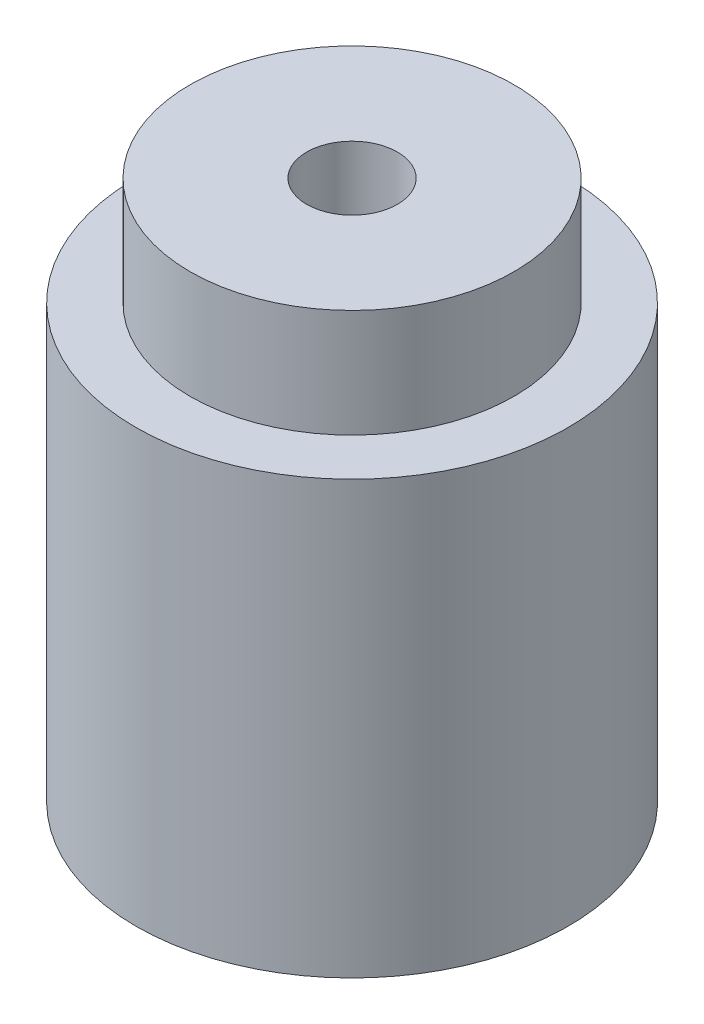
ISO-10303-21;
HEADER;
FILE_DESCRIPTION(('STEP AP214'),'2;1');
FILE_NAME('part.step','',(''),(''),'','','');
FILE_SCHEMA(('AUTOMOTIVE_DESIGN { 1 0 10303 214 1 1 1 1 }'));
ENDSEC;
DATA;
#1=APPLICATION_CONTEXT('core data for automotive mechanical design processes');
#2=APPLICATION_PROTOCOL_DEFINITION('international standard','automotive_design',2000,#1);
#3=PRODUCT_CONTEXT('',#1,'mechanical');
#4=PRODUCT('Part','Part','',(#3));
#5=PRODUCT_RELATED_PRODUCT_CATEGORY('part','',(#4));
#6=PRODUCT_DEFINITION_FORMATION('','',#4);
#7=PRODUCT_DEFINITION_CONTEXT('part definition',#1,'design');
#8=PRODUCT_DEFINITION('design','',#6,#7);
#9=PRODUCT_DEFINITION_SHAPE('','',#8);
#10=(LENGTH_UNIT() NAMED_UNIT(*) SI_UNIT(.MILLI.,.METRE.));
#11=(NAMED_UNIT(*) PLANE_ANGLE_UNIT() SI_UNIT($,.RADIAN.));
#12=(NAMED_UNIT(*) SI_UNIT($,.STERADIAN.) SOLID_ANGLE_UNIT());
#13=UNCERTAINTY_MEASURE_WITH_UNIT(LENGTH_MEASURE(1.E-05),#10,'distance_accuracy_value','');
#14=(GEOMETRIC_REPRESENTATION_CONTEXT(3) GLOBAL_UNCERTAINTY_ASSIGNED_CONTEXT((#13)) GLOBAL_UNIT_ASSIGNED_CONTEXT((#10,
#11,#12)) REPRESENTATION_CONTEXT('',''));
#15=CARTESIAN_POINT('',(0.,0.,0.));
#16=DIRECTION('',(0.,0.,1.));
#17=DIRECTION('',(1.,0.,0.));
#18=AXIS2_PLACEMENT_3D('',#15,#16,#17);
#19=CARTESIAN_POINT('',(0.,25.,0.));
#20=DIRECTION('',(0.,1.,0.));
#21=DIRECTION('',(0.,0.,1.));
#22=AXIS2_PLACEMENT_3D('',#19,#20,#21);
#23=PLANE('',#22);
#24=CARTESIAN_POINT('',(0.,25.,0.));
#25=DIRECTION('',(0.,1.,0.));
#26=DIRECTION('',(0.,0.,1.));
#27=AXIS2_PLACEMENT_3D('',#24,#25,#26);
#28=CIRCLE('',#27,2.1);
#29=CARTESIAN_POINT('',(0.,25.,2.1));
#30=VERTEX_POINT('',#29);
#31=EDGE_CURVE('E59',#30,#30,#28,.T.);
#32=ORIENTED_EDGE('',*,*,#31,.F.);
#33=EDGE_LOOP('',(#32));
#34=FACE_BOUND('',#33,.T.);
#35=CARTESIAN_POINT('',(0.,25.,0.));
#36=DIRECTION('',(0.,1.,0.));
#37=DIRECTION('',(0.,0.,1.));
#38=AXIS2_PLACEMENT_3D('',#35,#36,#37);
#39=CIRCLE('',#38,7.5);
#40=CARTESIAN_POINT('',(0.,25.,7.5));
#41=VERTEX_POINT('',#40);
#42=EDGE_CURVE('E67',#41,#41,#39,.T.);
#43=ORIENTED_EDGE('',*,*,#42,.T.);
#44=EDGE_LOOP('',(#43));
#45=FACE_BOUND('',#44,.T.);
#46=ADVANCED_FACE('F41',(#34,#45),#23,.T.);
#47=CARTESIAN_POINT('',(0.,11.2618072999579,0.));
#48=DIRECTION('',(0.,1.,0.));
#49=DIRECTION('',(0.,0.,1.));
#50=AXIS2_PLACEMENT_3D('',#47,#48,#49);
#51=CONICAL_SURFACE('',#50,2.1,1.02974425867665);
#52=CARTESIAN_POINT('',(0.,10.,0.));
#53=VERTEX_POINT('',#52);
#54=VERTEX_LOOP('',#53);
#55=FACE_BOUND('',#54,.T.);
#56=CARTESIAN_POINT('',(0.,11.2618072999579,0.));
#57=DIRECTION('',(0.,1.,0.));
#58=DIRECTION('',(0.,0.,1.));
#59=AXIS2_PLACEMENT_3D('',#56,#57,#58);
#60=CIRCLE('',#59,2.1);
#61=CARTESIAN_POINT('',(0.,11.2618072999579,2.1));
#62=VERTEX_POINT('',#61);
#63=EDGE_CURVE('E48',#62,#62,#60,.T.);
#64=ORIENTED_EDGE('',*,*,#63,.T.);
#65=EDGE_LOOP('',(#64));
#66=FACE_BOUND('',#65,.T.);
#67=ADVANCED_FACE('F51',(#55,#66),#51,.F.);
#68=CARTESIAN_POINT('',(0.,25.,0.));
#69=DIRECTION('',(0.,1.,0.));
#70=DIRECTION('',(0.,0.,1.));
#71=AXIS2_PLACEMENT_3D('',#68,#69,#70);
#72=CYLINDRICAL_SURFACE('',#71,2.1);
#73=ORIENTED_EDGE('',*,*,#63,.F.);
#74=EDGE_LOOP('',(#73));
#75=FACE_BOUND('',#74,.T.);
#76=ORIENTED_EDGE('',*,*,#31,.T.);
#77=EDGE_LOOP('',(#76));
#78=FACE_BOUND('',#77,.T.);
#79=ADVANCED_FACE('F54',(#75,#78),#72,.F.);
#80=CARTESIAN_POINT('',(0.,20.,0.));
#81=DIRECTION('',(0.,1.,0.));
#82=DIRECTION('',(0.,0.,1.));
#83=AXIS2_PLACEMENT_3D('',#80,#81,#82);
#84=PLANE('',#83);
#85=CARTESIAN_POINT('',(0.,20.,0.));
#86=DIRECTION('',(0.,1.,0.));
#87=DIRECTION('',(0.,0.,1.));
#88=AXIS2_PLACEMENT_3D('',#85,#86,#87);
#89=CIRCLE('',#88,7.5);
#90=CARTESIAN_POINT('',(0.,20.,7.5));
#91=VERTEX_POINT('',#90);
#92=EDGE_CURVE('E66',#91,#91,#89,.T.);
#93=ORIENTED_EDGE('',*,*,#92,.F.);
#94=EDGE_LOOP('',(#93));
#95=FACE_BOUND('',#94,.T.);
#96=CARTESIAN_POINT('',(0.,20.,0.));
#97=DIRECTION('',(0.,1.,0.));
#98=DIRECTION('',(0.,0.,1.));
#99=AXIS2_PLACEMENT_3D('',#96,#97,#98);
#100=CIRCLE('',#99,10.);
#101=CARTESIAN_POINT('',(0.,20.,10.));
#102=VERTEX_POINT('',#101);
#103=EDGE_CURVE('E61',#102,#102,#100,.T.);
#104=ORIENTED_EDGE('',*,*,#103,.T.);
#105=EDGE_LOOP('',(#104));
#106=FACE_BOUND('',#105,.T.);
#107=ADVANCED_FACE('F76',(#95,#106),#84,.T.);
#108=CARTESIAN_POINT('',(0.,20.,0.));
#109=DIRECTION('',(0.,1.,0.));
#110=DIRECTION('',(0.,0.,1.));
#111=AXIS2_PLACEMENT_3D('',#108,#109,#110);
#112=CYLINDRICAL_SURFACE('',#111,7.5);
#113=ORIENTED_EDGE('',*,*,#92,.T.);
#114=EDGE_LOOP('',(#113));
#115=FACE_BOUND('',#114,.T.);
#116=ORIENTED_EDGE('',*,*,#42,.F.);
#117=EDGE_LOOP('',(#116));
#118=FACE_BOUND('',#117,.T.);
#119=ADVANCED_FACE('F73',(#115,#118),#112,.T.);
#120=CARTESIAN_POINT('',(0.,0.,0.));
#121=DIRECTION('',(0.,1.,0.));
#122=DIRECTION('',(0.,0.,1.));
#123=AXIS2_PLACEMENT_3D('',#120,#121,#122);
#124=PLANE('',#123);
#125=CARTESIAN_POINT('',(0.,0.,0.));
#126=DIRECTION('',(0.,1.,0.));
#127=DIRECTION('',(0.,0.,1.));
#128=AXIS2_PLACEMENT_3D('',#125,#126,#127);
#129=CIRCLE('',#128,10.);
#130=CARTESIAN_POINT('',(0.,0.,10.));
#131=VERTEX_POINT('',#130);
#132=EDGE_CURVE('E11',#131,#131,#129,.T.);
#133=ORIENTED_EDGE('',*,*,#132,.F.);
#134=EDGE_LOOP('',(#133));
#135=FACE_BOUND('',#134,.T.);
#136=ADVANCED_FACE('F83',(#135),#124,.F.);
#137=CARTESIAN_POINT('',(0.,25.,0.));
#138=DIRECTION('',(0.,-1.,0.));
#139=DIRECTION('',(0.,0.,-1.));
#140=AXIS2_PLACEMENT_3D('',#137,#138,#139);
#141=CYLINDRICAL_SURFACE('',#140,10.);
#142=ORIENTED_EDGE('',*,*,#132,.T.);
#143=EDGE_LOOP('',(#142));
#144=FACE_BOUND('',#143,.T.);
#145=ORIENTED_EDGE('',*,*,#103,.F.);
#146=EDGE_LOOP('',(#145));
#147=FACE_BOUND('',#146,.T.);
#148=ADVANCED_FACE('F43',(#144,#147),#141,.T.);
#149=CLOSED_SHELL('',(#46,#67,#79,#107,#119,#136,#148));
#150=MANIFOLD_SOLID_BREP('B2',#149);
#151=ADVANCED_BREP_SHAPE_REPRESENTATION('',(#18,#150),#14);
#152=SHAPE_DEFINITION_REPRESENTATION(#9,#151);
ENDSEC;
END-ISO-10303-21;
